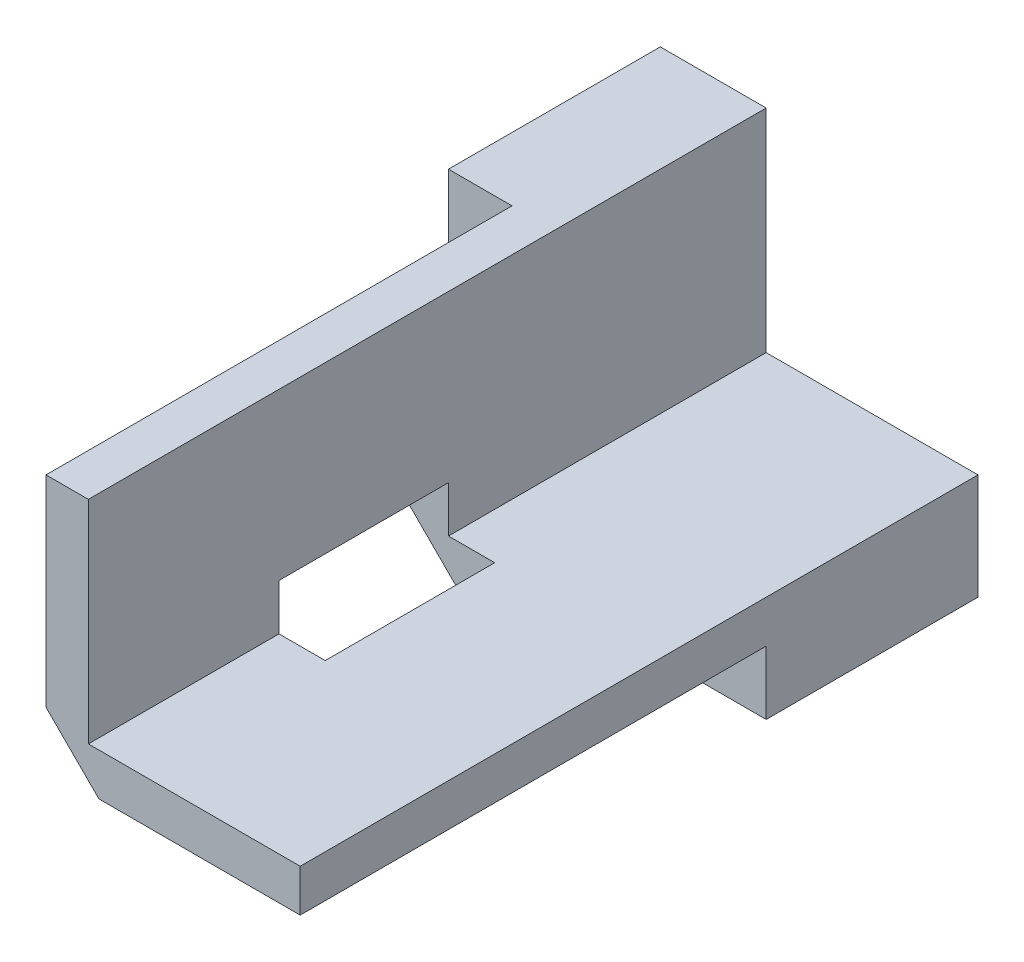
ISO-10303-21;
HEADER;
FILE_DESCRIPTION(('STEP AP214'),'2;1');
FILE_NAME('part.step','',(''),(''),'','','');
FILE_SCHEMA(('AUTOMOTIVE_DESIGN { 1 0 10303 214 1 1 1 1 }'));
ENDSEC;
DATA;
#1=APPLICATION_CONTEXT('core data for automotive mechanical design processes');
#2=APPLICATION_PROTOCOL_DEFINITION('international standard','automotive_design',2000,#1);
#3=PRODUCT_CONTEXT('',#1,'mechanical');
#4=PRODUCT('Part','Part','',(#3));
#5=PRODUCT_RELATED_PRODUCT_CATEGORY('part','',(#4));
#6=PRODUCT_DEFINITION_FORMATION('','',#4);
#7=PRODUCT_DEFINITION_CONTEXT('part definition',#1,'design');
#8=PRODUCT_DEFINITION('design','',#6,#7);
#9=PRODUCT_DEFINITION_SHAPE('','',#8);
#10=(LENGTH_UNIT() NAMED_UNIT(*) SI_UNIT(.MILLI.,.METRE.));
#11=(NAMED_UNIT(*) PLANE_ANGLE_UNIT() SI_UNIT($,.RADIAN.));
#12=(NAMED_UNIT(*) SI_UNIT($,.STERADIAN.) SOLID_ANGLE_UNIT());
#13=UNCERTAINTY_MEASURE_WITH_UNIT(LENGTH_MEASURE(1.E-05),#10,'distance_accuracy_value','');
#14=(GEOMETRIC_REPRESENTATION_CONTEXT(3) GLOBAL_UNCERTAINTY_ASSIGNED_CONTEXT((#13)) GLOBAL_UNIT_ASSIGNED_CONTEXT((#10,
#11,#12)) REPRESENTATION_CONTEXT('',''));
#15=CARTESIAN_POINT('',(0.,0.,0.));
#16=DIRECTION('',(0.,0.,1.));
#17=DIRECTION('',(1.,0.,0.));
#18=AXIS2_PLACEMENT_3D('',#15,#16,#17);
#19=CARTESIAN_POINT('',(-5.,10.,32.));
#20=DIRECTION('',(0.,-1.,0.));
#21=DIRECTION('',(0.,0.,-1.));
#22=AXIS2_PLACEMENT_3D('',#19,#20,#21);
#23=PLANE('',#22);
#24=DIRECTION('',(0.,0.,1.));
#25=VECTOR('',#24,1.);
#26=CARTESIAN_POINT('',(-2.,10.,-21.2132034355964));
#27=LINE('',#26,#25);
#28=CARTESIAN_POINT('',(-2.,10.,10.));
#29=VERTEX_POINT('',#28);
#30=CARTESIAN_POINT('',(-2.,10.,32.));
#31=VERTEX_POINT('',#30);
#32=EDGE_CURVE('E216',#29,#31,#27,.T.);
#33=ORIENTED_EDGE('',*,*,#32,.T.);
#34=DIRECTION('',(-1.,0.,0.));
#35=VECTOR('',#34,1.);
#36=CARTESIAN_POINT('',(-5.,10.,32.));
#37=LINE('',#36,#35);
#38=CARTESIAN_POINT('',(0.,10.,32.));
#39=VERTEX_POINT('',#38);
#40=EDGE_CURVE('E232',#39,#31,#37,.T.);
#41=ORIENTED_EDGE('',*,*,#40,.F.);
#42=DIRECTION('',(0.,0.,-1.));
#43=VECTOR('',#42,1.);
#44=CARTESIAN_POINT('',(0.,10.,32.));
#45=LINE('',#44,#43);
#46=CARTESIAN_POINT('',(0.,10.,0.));
#47=VERTEX_POINT('',#46);
#48=EDGE_CURVE('E242',#39,#47,#45,.T.);
#49=ORIENTED_EDGE('',*,*,#48,.T.);
#50=DIRECTION('',(-1.,0.,0.));
#51=VECTOR('',#50,1.);
#52=CARTESIAN_POINT('',(-5.,10.,0.));
#53=LINE('',#52,#51);
#54=CARTESIAN_POINT('',(-5.,10.,0.));
#55=VERTEX_POINT('',#54);
#56=EDGE_CURVE('E219',#47,#55,#53,.T.);
#57=ORIENTED_EDGE('',*,*,#56,.T.);
#58=DIRECTION('',(0.,0.,-1.));
#59=VECTOR('',#58,1.);
#60=CARTESIAN_POINT('',(-5.,10.,32.));
#61=LINE('',#60,#59);
#62=CARTESIAN_POINT('',(-5.,10.,10.));
#63=VERTEX_POINT('',#62);
#64=EDGE_CURVE('E268',#63,#55,#61,.T.);
#65=ORIENTED_EDGE('',*,*,#64,.F.);
#66=DIRECTION('',(-1.,0.,0.));
#67=VECTOR('',#66,1.);
#68=CARTESIAN_POINT('',(2.5,10.,10.));
#69=LINE('',#68,#67);
#70=EDGE_CURVE('E231',#29,#63,#69,.T.);
#71=ORIENTED_EDGE('',*,*,#70,.F.);
#72=EDGE_LOOP('',(#33,#41,#49,#57,#65,#71));
#73=FACE_BOUND('',#72,.T.);
#74=ADVANCED_FACE('F33',(#73),#23,.F.);
#75=CARTESIAN_POINT('',(10.,0.,32.));
#76=DIRECTION('',(-1.,0.,0.));
#77=DIRECTION('',(0.,0.,1.));
#78=AXIS2_PLACEMENT_3D('',#75,#76,#77);
#79=PLANE('',#78);
#80=DIRECTION('',(0.,0.,1.));
#81=VECTOR('',#80,1.);
#82=CARTESIAN_POINT('',(10.,-2.,-21.2132034355964));
#83=LINE('',#82,#81);
#84=CARTESIAN_POINT('',(10.,-2.,10.));
#85=VERTEX_POINT('',#84);
#86=CARTESIAN_POINT('',(10.,-2.,32.));
#87=VERTEX_POINT('',#86);
#88=EDGE_CURVE('E225',#85,#87,#83,.T.);
#89=ORIENTED_EDGE('',*,*,#88,.F.);
#90=DIRECTION('',(0.,1.,0.));
#91=VECTOR('',#90,1.);
#92=CARTESIAN_POINT('',(10.,-14.1414213562373,10.));
#93=LINE('',#92,#91);
#94=CARTESIAN_POINT('',(10.,-5.,10.));
#95=VERTEX_POINT('',#94);
#96=EDGE_CURVE('E229',#95,#85,#93,.T.);
#97=ORIENTED_EDGE('',*,*,#96,.F.);
#98=DIRECTION('',(0.,0.,-1.));
#99=VECTOR('',#98,1.);
#100=CARTESIAN_POINT('',(10.,-5.,32.));
#101=LINE('',#100,#99);
#102=CARTESIAN_POINT('',(10.,-5.,0.));
#103=VERTEX_POINT('',#102);
#104=EDGE_CURVE('E266',#95,#103,#101,.T.);
#105=ORIENTED_EDGE('',*,*,#104,.T.);
#106=DIRECTION('',(0.,1.,0.));
#107=VECTOR('',#106,1.);
#108=CARTESIAN_POINT('',(10.,0.,0.));
#109=LINE('',#108,#107);
#110=CARTESIAN_POINT('',(10.,0.,0.));
#111=VERTEX_POINT('',#110);
#112=EDGE_CURVE('E251',#103,#111,#109,.T.);
#113=ORIENTED_EDGE('',*,*,#112,.T.);
#114=DIRECTION('',(0.,0.,-1.));
#115=VECTOR('',#114,1.);
#116=CARTESIAN_POINT('',(10.,0.,32.));
#117=LINE('',#116,#115);
#118=CARTESIAN_POINT('',(10.,0.,32.));
#119=VERTEX_POINT('',#118);
#120=EDGE_CURVE('E263',#119,#111,#117,.T.);
#121=ORIENTED_EDGE('',*,*,#120,.F.);
#122=DIRECTION('',(0.,1.,0.));
#123=VECTOR('',#122,1.);
#124=CARTESIAN_POINT('',(10.,0.,32.));
#125=LINE('',#124,#123);
#126=EDGE_CURVE('E235',#87,#119,#125,.T.);
#127=ORIENTED_EDGE('',*,*,#126,.F.);
#128=EDGE_LOOP('',(#89,#97,#105,#113,#121,#127));
#129=FACE_BOUND('',#128,.T.);
#130=ADVANCED_FACE('F314',(#129),#79,.F.);
#131=CARTESIAN_POINT('',(0.,10.,32.));
#132=DIRECTION('',(0.,0.,-1.));
#133=DIRECTION('',(-1.,0.,0.));
#134=AXIS2_PLACEMENT_3D('',#131,#132,#133);
#135=PLANE('',#134);
#136=DIRECTION('',(0.,-1.,0.));
#137=VECTOR('',#136,1.);
#138=CARTESIAN_POINT('',(-2.,-14.1414213562373,32.));
#139=LINE('',#138,#137);
#140=CARTESIAN_POINT('',(-2.,0.500000000000006,32.));
#141=VERTEX_POINT('',#140);
#142=EDGE_CURVE('E217',#31,#141,#139,.T.);
#143=ORIENTED_EDGE('',*,*,#142,.T.);
#144=DIRECTION('',(-0.707106781186549,0.707106781186546,0.));
#145=VECTOR('',#144,1.);
#146=CARTESIAN_POINT('',(-2.,0.500000000000006,32.));
#147=LINE('',#146,#145);
#148=CARTESIAN_POINT('',(0.500000000000017,-2.,32.));
#149=VERTEX_POINT('',#148);
#150=EDGE_CURVE('E193',#141,#149,#147,.F.);
#151=ORIENTED_EDGE('',*,*,#150,.T.);
#152=DIRECTION('',(1.,0.,0.));
#153=VECTOR('',#152,1.);
#154=CARTESIAN_POINT('',(2.5,-2.,32.));
#155=LINE('',#154,#153);
#156=EDGE_CURVE('E294',#149,#87,#155,.T.);
#157=ORIENTED_EDGE('',*,*,#156,.T.);
#158=ORIENTED_EDGE('',*,*,#126,.T.);
#159=DIRECTION('',(-1.,0.,0.));
#160=VECTOR('',#159,1.);
#161=CARTESIAN_POINT('',(0.,0.,32.));
#162=LINE('',#161,#160);
#163=CARTESIAN_POINT('',(0.,0.,32.));
#164=VERTEX_POINT('',#163);
#165=EDGE_CURVE('E238',#119,#164,#162,.T.);
#166=ORIENTED_EDGE('',*,*,#165,.T.);
#167=DIRECTION('',(0.,1.,0.));
#168=VECTOR('',#167,1.);
#169=CARTESIAN_POINT('',(0.,10.,32.));
#170=LINE('',#169,#168);
#171=EDGE_CURVE('E240',#164,#39,#170,.T.);
#172=ORIENTED_EDGE('',*,*,#171,.T.);
#173=ORIENTED_EDGE('',*,*,#40,.T.);
#174=EDGE_LOOP('',(#143,#151,#157,#158,#166,#172,#173));
#175=FACE_BOUND('',#174,.T.);
#176=ADVANCED_FACE('F325',(#175),#135,.F.);
#177=CARTESIAN_POINT('',(-5.,10.,32.));
#178=DIRECTION('',(1.,0.,0.));
#179=DIRECTION('',(0.,1.,0.));
#180=AXIS2_PLACEMENT_3D('',#177,#178,#179);
#181=PLANE('',#180);
#182=DIRECTION('',(0.,0.,1.));
#183=VECTOR('',#182,1.);
#184=CARTESIAN_POINT('',(-5.,-2.99999999999999,32.));
#185=LINE('',#184,#183);
#186=CARTESIAN_POINT('',(-5.,-2.99999999999999,0.));
#187=VERTEX_POINT('',#186);
#188=CARTESIAN_POINT('',(-5.,-2.99999999999999,10.));
#189=VERTEX_POINT('',#188);
#190=EDGE_CURVE('E170',#187,#189,#185,.T.);
#191=ORIENTED_EDGE('',*,*,#190,.T.);
#192=DIRECTION('',(0.,-1.,0.));
#193=VECTOR('',#192,1.);
#194=CARTESIAN_POINT('',(-5.,-14.1414213562373,10.));
#195=LINE('',#194,#193);
#196=EDGE_CURVE('E279',#63,#189,#195,.T.);
#197=ORIENTED_EDGE('',*,*,#196,.F.);
#198=ORIENTED_EDGE('',*,*,#64,.T.);
#199=DIRECTION('',(0.,-1.,0.));
#200=VECTOR('',#199,1.);
#201=CARTESIAN_POINT('',(-5.,10.,0.));
#202=LINE('',#201,#200);
#203=EDGE_CURVE('E245',#55,#187,#202,.T.);
#204=ORIENTED_EDGE('',*,*,#203,.T.);
#205=EDGE_LOOP('',(#191,#197,#198,#204));
#206=FACE_BOUND('',#205,.T.);
#207=ADVANCED_FACE('F278',(#206),#181,.F.);
#208=CARTESIAN_POINT('',(-5.,-5.,32.));
#209=DIRECTION('',(0.,1.,0.));
#210=DIRECTION('',(0.,0.,1.));
#211=AXIS2_PLACEMENT_3D('',#208,#209,#210);
#212=PLANE('',#211);
#213=ORIENTED_EDGE('',*,*,#104,.F.);
#214=DIRECTION('',(1.,0.,0.));
#215=VECTOR('',#214,1.);
#216=CARTESIAN_POINT('',(2.5,-5.,10.));
#217=LINE('',#216,#215);
#218=CARTESIAN_POINT('',(-3.,-5.,10.));
#219=VERTEX_POINT('',#218);
#220=EDGE_CURVE('E228',#219,#95,#217,.T.);
#221=ORIENTED_EDGE('',*,*,#220,.F.);
#222=DIRECTION('',(0.,0.,-1.));
#223=VECTOR('',#222,1.);
#224=CARTESIAN_POINT('',(-3.,-5.,32.));
#225=LINE('',#224,#223);
#226=CARTESIAN_POINT('',(-3.,-5.,0.));
#227=VERTEX_POINT('',#226);
#228=EDGE_CURVE('E270',#219,#227,#225,.T.);
#229=ORIENTED_EDGE('',*,*,#228,.T.);
#230=DIRECTION('',(1.,0.,0.));
#231=VECTOR('',#230,1.);
#232=CARTESIAN_POINT('',(-5.,-5.,0.));
#233=LINE('',#232,#231);
#234=EDGE_CURVE('E248',#227,#103,#233,.T.);
#235=ORIENTED_EDGE('',*,*,#234,.T.);
#236=EDGE_LOOP('',(#213,#221,#229,#235));
#237=FACE_BOUND('',#236,.T.);
#238=ADVANCED_FACE('F312',(#237),#212,.F.);
#239=CARTESIAN_POINT('',(0.,0.,32.));
#240=DIRECTION('',(0.,-1.,0.));
#241=DIRECTION('',(1.,0.,0.));
#242=AXIS2_PLACEMENT_3D('',#239,#240,#241);
#243=PLANE('',#242);
#244=DIRECTION('',(0.,0.,-1.));
#245=VECTOR('',#244,1.);
#246=CARTESIAN_POINT('',(0.,0.,32.));
#247=LINE('',#246,#245);
#248=CARTESIAN_POINT('',(0.,0.,15.));
#249=VERTEX_POINT('',#248);
#250=CARTESIAN_POINT('',(0.,0.,0.));
#251=VERTEX_POINT('',#250);
#252=EDGE_CURVE('E259',#249,#251,#247,.T.);
#253=ORIENTED_EDGE('',*,*,#252,.F.);
#254=DIRECTION('',(1.,0.,0.));
#255=VECTOR('',#254,1.);
#256=CARTESIAN_POINT('',(0.,0.,15.));
#257=LINE('',#256,#255);
#258=CARTESIAN_POINT('',(2.18233764908629,0.,15.));
#259=VERTEX_POINT('',#258);
#260=EDGE_CURVE('E297',#249,#259,#257,.T.);
#261=ORIENTED_EDGE('',*,*,#260,.T.);
#262=DIRECTION('',(0.,0.,-1.));
#263=VECTOR('',#262,1.);
#264=CARTESIAN_POINT('',(2.18233764908629,0.,32.));
#265=LINE('',#264,#263);
#266=CARTESIAN_POINT('',(2.18233764908629,0.,23.));
#267=VERTEX_POINT('',#266);
#268=EDGE_CURVE('E342',#267,#259,#265,.T.);
#269=ORIENTED_EDGE('',*,*,#268,.F.);
#270=DIRECTION('',(-1.,0.,0.));
#271=VECTOR('',#270,1.);
#272=CARTESIAN_POINT('',(0.,0.,23.));
#273=LINE('',#272,#271);
#274=CARTESIAN_POINT('',(0.,0.,23.));
#275=VERTEX_POINT('',#274);
#276=EDGE_CURVE('E205',#267,#275,#273,.T.);
#277=ORIENTED_EDGE('',*,*,#276,.T.);
#278=EDGE_CURVE('E260',#164,#275,#247,.T.);
#279=ORIENTED_EDGE('',*,*,#278,.F.);
#280=ORIENTED_EDGE('',*,*,#165,.F.);
#281=ORIENTED_EDGE('',*,*,#120,.T.);
#282=DIRECTION('',(-1.,0.,0.));
#283=VECTOR('',#282,1.);
#284=CARTESIAN_POINT('',(0.,0.,0.));
#285=LINE('',#284,#283);
#286=EDGE_CURVE('E253',#111,#251,#285,.T.);
#287=ORIENTED_EDGE('',*,*,#286,.T.);
#288=EDGE_LOOP('',(#253,#261,#269,#277,#279,#280,#281,#287));
#289=FACE_BOUND('',#288,.T.);
#290=ADVANCED_FACE('F332',(#289),#243,.F.);
#291=CARTESIAN_POINT('',(0.,10.,32.));
#292=DIRECTION('',(-1.,0.,0.));
#293=DIRECTION('',(0.,-1.,0.));
#294=AXIS2_PLACEMENT_3D('',#291,#292,#293);
#295=PLANE('',#294);
#296=DIRECTION('',(0.,0.,1.));
#297=VECTOR('',#296,1.);
#298=CARTESIAN_POINT('',(0.,2.18233764908629,32.));
#299=LINE('',#298,#297);
#300=CARTESIAN_POINT('',(0.,2.18233764908629,15.));
#301=VERTEX_POINT('',#300);
#302=CARTESIAN_POINT('',(0.,2.18233764908629,23.));
#303=VERTEX_POINT('',#302);
#304=EDGE_CURVE('E339',#301,#303,#299,.T.);
#305=ORIENTED_EDGE('',*,*,#304,.F.);
#306=DIRECTION('',(0.,-1.,0.));
#307=VECTOR('',#306,1.);
#308=CARTESIAN_POINT('',(0.,10.,15.));
#309=LINE('',#308,#307);
#310=EDGE_CURVE('E177',#301,#249,#309,.T.);
#311=ORIENTED_EDGE('',*,*,#310,.T.);
#312=ORIENTED_EDGE('',*,*,#252,.T.);
#313=DIRECTION('',(0.,1.,0.));
#314=VECTOR('',#313,1.);
#315=CARTESIAN_POINT('',(0.,10.,0.));
#316=LINE('',#315,#314);
#317=EDGE_CURVE('E236',#251,#47,#316,.T.);
#318=ORIENTED_EDGE('',*,*,#317,.T.);
#319=ORIENTED_EDGE('',*,*,#48,.F.);
#320=ORIENTED_EDGE('',*,*,#171,.F.);
#321=ORIENTED_EDGE('',*,*,#278,.T.);
#322=DIRECTION('',(0.,1.,0.));
#323=VECTOR('',#322,1.);
#324=CARTESIAN_POINT('',(0.,10.,23.));
#325=LINE('',#324,#323);
#326=EDGE_CURVE('E338',#275,#303,#325,.T.);
#327=ORIENTED_EDGE('',*,*,#326,.T.);
#328=EDGE_LOOP('',(#305,#311,#312,#318,#319,#320,#321,#327));
#329=FACE_BOUND('',#328,.T.);
#330=ADVANCED_FACE('F329',(#329),#295,.F.);
#331=CARTESIAN_POINT('',(0.,10.,0.));
#332=DIRECTION('',(0.,0.,-1.));
#333=DIRECTION('',(-1.,0.,0.));
#334=AXIS2_PLACEMENT_3D('',#331,#332,#333);
#335=PLANE('',#334);
#336=CARTESIAN_POINT('',(-2.,-2.,0.));
#337=DIRECTION('',(0.,0.,-1.));
#338=DIRECTION('',(-1.,0.,0.));
#339=AXIS2_PLACEMENT_3D('',#336,#337,#338);
#340=CIRCLE('',#339,1.651);
#341=CARTESIAN_POINT('',(-3.651,-2.,0.));
#342=VERTEX_POINT('',#341);
#343=EDGE_CURVE('E357',#342,#342,#340,.T.);
#344=ORIENTED_EDGE('',*,*,#343,.F.);
#345=EDGE_LOOP('',(#344));
#346=FACE_BOUND('',#345,.T.);
#347=ORIENTED_EDGE('',*,*,#234,.F.);
#348=DIRECTION('',(0.707106781186546,-0.707106781186549,0.));
#349=VECTOR('',#348,1.);
#350=CARTESIAN_POINT('',(-9.00000000000001,1.00000000000004,0.));
#351=LINE('',#350,#349);
#352=EDGE_CURVE('E272',#227,#187,#351,.F.);
#353=ORIENTED_EDGE('',*,*,#352,.T.);
#354=ORIENTED_EDGE('',*,*,#203,.F.);
#355=ORIENTED_EDGE('',*,*,#56,.F.);
#356=ORIENTED_EDGE('',*,*,#317,.F.);
#357=ORIENTED_EDGE('',*,*,#286,.F.);
#358=ORIENTED_EDGE('',*,*,#112,.F.);
#359=EDGE_LOOP('',(#347,#353,#354,#355,#356,#357,#358));
#360=FACE_BOUND('',#359,.T.);
#361=ADVANCED_FACE('F306',(#346,#360),#335,.T.);
#362=CARTESIAN_POINT('',(-3.,-5.,32.));
#363=DIRECTION('',(0.707106781186549,0.707106781186546,0.));
#364=DIRECTION('',(-0.707106781186546,0.707106781186549,0.));
#365=AXIS2_PLACEMENT_3D('',#362,#363,#364);
#366=PLANE('',#365);
#367=DIRECTION('',(0.707106781186546,-0.707106781186549,0.));
#368=VECTOR('',#367,1.);
#369=CARTESIAN_POINT('',(4.32071067811864,-12.3207106781187,10.));
#370=LINE('',#369,#368);
#371=EDGE_CURVE('E288',#189,#219,#370,.T.);
#372=ORIENTED_EDGE('',*,*,#371,.F.);
#373=ORIENTED_EDGE('',*,*,#190,.F.);
#374=ORIENTED_EDGE('',*,*,#352,.F.);
#375=ORIENTED_EDGE('',*,*,#228,.F.);
#376=EDGE_LOOP('',(#372,#373,#374,#375));
#377=FACE_BOUND('',#376,.T.);
#378=ADVANCED_FACE('F285',(#377),#366,.F.);
#379=CARTESIAN_POINT('',(2.5,-2.,-21.2132034355964));
#380=DIRECTION('',(0.,-1.,0.));
#381=DIRECTION('',(0.,0.,-1.));
#382=AXIS2_PLACEMENT_3D('',#379,#380,#381);
#383=PLANE('',#382);
#384=ORIENTED_EDGE('',*,*,#156,.F.);
#385=DIRECTION('',(0.,0.,-1.));
#386=VECTOR('',#385,1.);
#387=CARTESIAN_POINT('',(0.500000000000017,-2.,-21.2132034355964));
#388=LINE('',#387,#386);
#389=CARTESIAN_POINT('',(0.500000000000016,-2.,23.));
#390=VERTEX_POINT('',#389);
#391=EDGE_CURVE('E48',#149,#390,#388,.T.);
#392=ORIENTED_EDGE('',*,*,#391,.T.);
#393=DIRECTION('',(-1.,0.,0.));
#394=VECTOR('',#393,1.);
#395=CARTESIAN_POINT('',(2.49999999999999,-2.,23.));
#396=LINE('',#395,#394);
#397=CARTESIAN_POINT('',(4.18233764908628,-2.,23.));
#398=VERTEX_POINT('',#397);
#399=EDGE_CURVE('E324',#398,#390,#396,.T.);
#400=ORIENTED_EDGE('',*,*,#399,.F.);
#401=DIRECTION('',(0.,0.,-1.));
#402=VECTOR('',#401,1.);
#403=CARTESIAN_POINT('',(4.18233764908628,-2.,-21.2132034355964));
#404=LINE('',#403,#402);
#405=CARTESIAN_POINT('',(4.18233764908628,-2.,15.));
#406=VERTEX_POINT('',#405);
#407=EDGE_CURVE('E204',#398,#406,#404,.T.);
#408=ORIENTED_EDGE('',*,*,#407,.T.);
#409=DIRECTION('',(1.,0.,0.));
#410=VECTOR('',#409,1.);
#411=CARTESIAN_POINT('',(2.5,-2.,15.));
#412=LINE('',#411,#410);
#413=CARTESIAN_POINT('',(0.500000000000017,-2.,15.));
#414=VERTEX_POINT('',#413);
#415=EDGE_CURVE('E199',#414,#406,#412,.T.);
#416=ORIENTED_EDGE('',*,*,#415,.F.);
#417=DIRECTION('',(0.,0.,-1.));
#418=VECTOR('',#417,1.);
#419=CARTESIAN_POINT('',(0.500000000000017,-2.,-21.2132034355964));
#420=LINE('',#419,#418);
#421=CARTESIAN_POINT('',(0.500000000000017,-2.,10.));
#422=VERTEX_POINT('',#421);
#423=EDGE_CURVE('E55',#414,#422,#420,.T.);
#424=ORIENTED_EDGE('',*,*,#423,.T.);
#425=DIRECTION('',(1.,0.,0.));
#426=VECTOR('',#425,1.);
#427=CARTESIAN_POINT('',(2.5,-2.,10.));
#428=LINE('',#427,#426);
#429=EDGE_CURVE('E214',#422,#85,#428,.T.);
#430=ORIENTED_EDGE('',*,*,#429,.T.);
#431=ORIENTED_EDGE('',*,*,#88,.T.);
#432=EDGE_LOOP('',(#384,#392,#400,#408,#416,#424,#430,#431));
#433=FACE_BOUND('',#432,.T.);
#434=ADVANCED_FACE('F203',(#433),#383,.T.);
#435=CARTESIAN_POINT('',(-2.,-14.1414213562373,-21.2132034355964));
#436=DIRECTION('',(-1.,0.,0.));
#437=DIRECTION('',(0.,-1.,0.));
#438=AXIS2_PLACEMENT_3D('',#435,#436,#437);
#439=PLANE('',#438);
#440=DIRECTION('',(0.,1.,0.));
#441=VECTOR('',#440,1.);
#442=CARTESIAN_POINT('',(-2.,-14.1414213562373,23.));
#443=LINE('',#442,#441);
#444=CARTESIAN_POINT('',(-2.,0.500000000000006,23.));
#445=VERTEX_POINT('',#444);
#446=CARTESIAN_POINT('',(-2.,4.1823376490863,23.));
#447=VERTEX_POINT('',#446);
#448=EDGE_CURVE('E169',#445,#447,#443,.T.);
#449=ORIENTED_EDGE('',*,*,#448,.F.);
#450=DIRECTION('',(0.,0.,1.));
#451=VECTOR('',#450,1.);
#452=CARTESIAN_POINT('',(-2.,0.500000000000006,-21.2132034355964));
#453=LINE('',#452,#451);
#454=EDGE_CURVE('E187',#445,#141,#453,.T.);
#455=ORIENTED_EDGE('',*,*,#454,.T.);
#456=ORIENTED_EDGE('',*,*,#142,.F.);
#457=ORIENTED_EDGE('',*,*,#32,.F.);
#458=DIRECTION('',(0.,-1.,0.));
#459=VECTOR('',#458,1.);
#460=CARTESIAN_POINT('',(-2.,-14.1414213562373,10.));
#461=LINE('',#460,#459);
#462=CARTESIAN_POINT('',(-2.,0.500000000000006,10.));
#463=VERTEX_POINT('',#462);
#464=EDGE_CURVE('E211',#29,#463,#461,.T.);
#465=ORIENTED_EDGE('',*,*,#464,.T.);
#466=DIRECTION('',(0.,0.,1.));
#467=VECTOR('',#466,1.);
#468=CARTESIAN_POINT('',(-2.,0.500000000000006,-21.2132034355964));
#469=LINE('',#468,#467);
#470=CARTESIAN_POINT('',(-2.,0.500000000000006,15.));
#471=VERTEX_POINT('',#470);
#472=EDGE_CURVE('E185',#463,#471,#469,.T.);
#473=ORIENTED_EDGE('',*,*,#472,.T.);
#474=DIRECTION('',(0.,-1.,0.));
#475=VECTOR('',#474,1.);
#476=CARTESIAN_POINT('',(-2.,-14.1414213562373,15.));
#477=LINE('',#476,#475);
#478=CARTESIAN_POINT('',(-2.,4.1823376490863,15.));
#479=VERTEX_POINT('',#478);
#480=EDGE_CURVE('E175',#479,#471,#477,.T.);
#481=ORIENTED_EDGE('',*,*,#480,.F.);
#482=DIRECTION('',(0.,0.,1.));
#483=VECTOR('',#482,1.);
#484=CARTESIAN_POINT('',(-2.,4.1823376490863,-21.2132034355964));
#485=LINE('',#484,#483);
#486=EDGE_CURVE('E159',#479,#447,#485,.T.);
#487=ORIENTED_EDGE('',*,*,#486,.T.);
#488=EDGE_LOOP('',(#449,#455,#456,#457,#465,#473,#481,#487));
#489=FACE_BOUND('',#488,.T.);
#490=ADVANCED_FACE('F182',(#489),#439,.T.);
#491=CARTESIAN_POINT('',(0.,10.,10.));
#492=DIRECTION('',(0.,0.,-1.));
#493=DIRECTION('',(-1.,0.,0.));
#494=AXIS2_PLACEMENT_3D('',#491,#492,#493);
#495=PLANE('',#494);
#496=CARTESIAN_POINT('',(-2.,-2.,10.));
#497=DIRECTION('',(0.,0.,-1.));
#498=DIRECTION('',(-1.,0.,0.));
#499=AXIS2_PLACEMENT_3D('',#496,#497,#498);
#500=CIRCLE('',#499,1.651);
#501=CARTESIAN_POINT('',(-3.651,-2.,10.));
#502=VERTEX_POINT('',#501);
#503=EDGE_CURVE('E360',#502,#502,#500,.T.);
#504=ORIENTED_EDGE('',*,*,#503,.T.);
#505=EDGE_LOOP('',(#504));
#506=FACE_BOUND('',#505,.T.);
#507=ORIENTED_EDGE('',*,*,#464,.F.);
#508=ORIENTED_EDGE('',*,*,#70,.T.);
#509=ORIENTED_EDGE('',*,*,#196,.T.);
#510=ORIENTED_EDGE('',*,*,#371,.T.);
#511=ORIENTED_EDGE('',*,*,#220,.T.);
#512=ORIENTED_EDGE('',*,*,#96,.T.);
#513=ORIENTED_EDGE('',*,*,#429,.F.);
#514=DIRECTION('',(0.707106781186549,-0.707106781186546,0.));
#515=VECTOR('',#514,1.);
#516=CARTESIAN_POINT('',(-5.74999999999999,4.24999999999998,10.));
#517=LINE('',#516,#515);
#518=EDGE_CURVE('E12',#422,#463,#517,.F.);
#519=ORIENTED_EDGE('',*,*,#518,.T.);
#520=EDGE_LOOP('',(#507,#508,#509,#510,#511,#512,#513,#519));
#521=FACE_BOUND('',#520,.T.);
#522=ADVANCED_FACE('F210',(#506,#521),#495,.F.);
#523=CARTESIAN_POINT('',(-8.8083261120685,10.9906637611548,15.));
#524=DIRECTION('',(0.,0.,-1.));
#525=DIRECTION('',(0.,1.,0.));
#526=AXIS2_PLACEMENT_3D('',#523,#524,#525);
#527=PLANE('',#526);
#528=ORIENTED_EDGE('',*,*,#480,.T.);
#529=DIRECTION('',(-0.707106781186549,0.707106781186546,0.));
#530=VECTOR('',#529,1.);
#531=CARTESIAN_POINT('',(-2.,0.500000000000009,15.));
#532=LINE('',#531,#530);
#533=EDGE_CURVE('E41',#471,#414,#532,.F.);
#534=ORIENTED_EDGE('',*,*,#533,.T.);
#535=ORIENTED_EDGE('',*,*,#415,.T.);
#536=DIRECTION('',(0.707106781186547,-0.707106781186549,0.));
#537=VECTOR('',#536,1.);
#538=CARTESIAN_POINT('',(-8.8083261120685,10.9906637611548,15.));
#539=LINE('',#538,#537);
#540=EDGE_CURVE('E179',#259,#406,#539,.T.);
#541=ORIENTED_EDGE('',*,*,#540,.F.);
#542=ORIENTED_EDGE('',*,*,#260,.F.);
#543=ORIENTED_EDGE('',*,*,#310,.F.);
#544=EDGE_CURVE('E162',#479,#301,#539,.T.);
#545=ORIENTED_EDGE('',*,*,#544,.F.);
#546=EDGE_LOOP('',(#528,#534,#535,#541,#542,#543,#545));
#547=FACE_BOUND('',#546,.T.);
#548=ADVANCED_FACE('F174',(#547),#527,.F.);
#549=CARTESIAN_POINT('',(-8.8083261120685,10.9906637611548,23.));
#550=DIRECTION('',(0.,0.,1.));
#551=DIRECTION('',(0.,-1.,0.));
#552=AXIS2_PLACEMENT_3D('',#549,#550,#551);
#553=PLANE('',#552);
#554=ORIENTED_EDGE('',*,*,#399,.T.);
#555=DIRECTION('',(0.707106781186549,-0.707106781186546,0.));
#556=VECTOR('',#555,1.);
#557=CARTESIAN_POINT('',(-2.00000000000001,0.500000000000013,23.));
#558=LINE('',#557,#556);
#559=EDGE_CURVE('E197',#390,#445,#558,.F.);
#560=ORIENTED_EDGE('',*,*,#559,.T.);
#561=ORIENTED_EDGE('',*,*,#448,.T.);
#562=DIRECTION('',(-0.707106781186547,0.707106781186548,0.));
#563=VECTOR('',#562,1.);
#564=CARTESIAN_POINT('',(-8.8083261120685,10.9906637611548,23.));
#565=LINE('',#564,#563);
#566=EDGE_CURVE('E165',#303,#447,#565,.T.);
#567=ORIENTED_EDGE('',*,*,#566,.F.);
#568=ORIENTED_EDGE('',*,*,#326,.F.);
#569=ORIENTED_EDGE('',*,*,#276,.F.);
#570=EDGE_CURVE('E349',#398,#267,#565,.T.);
#571=ORIENTED_EDGE('',*,*,#570,.F.);
#572=EDGE_LOOP('',(#554,#560,#561,#567,#568,#569,#571));
#573=FACE_BOUND('',#572,.T.);
#574=ADVANCED_FACE('F322',(#573),#553,.F.);
#575=CARTESIAN_POINT('',(10.9906637611548,-8.80832611206854,15.));
#576=DIRECTION('',(-0.707106781186549,-0.707106781186546,0.));
#577=DIRECTION('',(0.707106781186546,-0.707106781186549,0.));
#578=AXIS2_PLACEMENT_3D('',#575,#576,#577);
#579=PLANE('',#578);
#580=ORIENTED_EDGE('',*,*,#268,.T.);
#581=ORIENTED_EDGE('',*,*,#540,.T.);
#582=ORIENTED_EDGE('',*,*,#407,.F.);
#583=ORIENTED_EDGE('',*,*,#570,.T.);
#584=EDGE_LOOP('',(#580,#581,#582,#583));
#585=FACE_BOUND('',#584,.T.);
#586=ADVANCED_FACE('F405',(#585),#579,.T.);
#587=ORIENTED_EDGE('',*,*,#304,.T.);
#588=ORIENTED_EDGE('',*,*,#566,.T.);
#589=ORIENTED_EDGE('',*,*,#486,.F.);
#590=ORIENTED_EDGE('',*,*,#544,.T.);
#591=EDGE_LOOP('',(#587,#588,#589,#590));
#592=FACE_BOUND('',#591,.T.);
#593=ADVANCED_FACE('F161',(#592),#579,.T.);
#594=CARTESIAN_POINT('',(-2.,0.500000000000006,-21.2132034355964));
#595=DIRECTION('',(0.707106781186546,0.707106781186549,0.));
#596=DIRECTION('',(-0.707106781186549,0.707106781186546,0.));
#597=AXIS2_PLACEMENT_3D('',#594,#595,#596);
#598=PLANE('',#597);
#599=ORIENTED_EDGE('',*,*,#559,.F.);
#600=ORIENTED_EDGE('',*,*,#391,.F.);
#601=ORIENTED_EDGE('',*,*,#150,.F.);
#602=ORIENTED_EDGE('',*,*,#454,.F.);
#603=EDGE_LOOP('',(#599,#600,#601,#602));
#604=FACE_BOUND('',#603,.T.);
#605=ADVANCED_FACE('F319',(#604),#598,.F.);
#606=CARTESIAN_POINT('',(-2.,0.500000000000006,-21.2132034355964));
#607=DIRECTION('',(0.707106781186546,0.707106781186549,0.));
#608=DIRECTION('',(-0.707106781186549,0.707106781186546,0.));
#609=AXIS2_PLACEMENT_3D('',#606,#607,#608);
#610=PLANE('',#609);
#611=ORIENTED_EDGE('',*,*,#518,.F.);
#612=ORIENTED_EDGE('',*,*,#423,.F.);
#613=ORIENTED_EDGE('',*,*,#533,.F.);
#614=ORIENTED_EDGE('',*,*,#472,.F.);
#615=EDGE_LOOP('',(#611,#612,#613,#614));
#616=FACE_BOUND('',#615,.T.);
#617=ADVANCED_FACE('F35',(#616),#610,.F.);
#618=CARTESIAN_POINT('',(-2.,-2.,9.83993255676526));
#619=DIRECTION('',(0.,0.,1.));
#620=DIRECTION('',(1.,0.,0.));
#621=AXIS2_PLACEMENT_3D('',#618,#619,#620);
#622=CONICAL_SURFACE('',#621,1.4224,0.959931088596886);
#623=ORIENTED_EDGE('',*,*,#503,.F.);
#624=EDGE_LOOP('',(#623));
#625=FACE_BOUND('',#624,.T.);
#626=CARTESIAN_POINT('',(-2.,-2.,9.83993255676526));
#627=DIRECTION('',(0.,0.,-1.));
#628=DIRECTION('',(-1.,0.,0.));
#629=AXIS2_PLACEMENT_3D('',#626,#627,#628);
#630=CIRCLE('',#629,1.4224);
#631=CARTESIAN_POINT('',(-3.4224,-2.,9.83993255676526));
#632=VERTEX_POINT('',#631);
#633=EDGE_CURVE('E351',#632,#632,#630,.T.);
#634=ORIENTED_EDGE('',*,*,#633,.T.);
#635=EDGE_LOOP('',(#634));
#636=FACE_BOUND('',#635,.T.);
#637=ADVANCED_FACE('F365',(#625,#636),#622,.F.);
#638=CARTESIAN_POINT('',(-2.,-2.,0.));
#639=DIRECTION('',(0.,0.,-1.));
#640=DIRECTION('',(-1.,0.,0.));
#641=AXIS2_PLACEMENT_3D('',#638,#639,#640);
#642=CYLINDRICAL_SURFACE('',#641,1.4224);
#643=ORIENTED_EDGE('',*,*,#633,.F.);
#644=EDGE_LOOP('',(#643));
#645=FACE_BOUND('',#644,.T.);
#646=CARTESIAN_POINT('',(-2.,-2.,0.16006744323474));
#647=DIRECTION('',(0.,0.,-1.));
#648=DIRECTION('',(-1.,0.,0.));
#649=AXIS2_PLACEMENT_3D('',#646,#647,#648);
#650=CIRCLE('',#649,1.4224);
#651=CARTESIAN_POINT('',(-3.4224,-2.,0.16006744323474));
#652=VERTEX_POINT('',#651);
#653=EDGE_CURVE('E354',#652,#652,#650,.T.);
#654=ORIENTED_EDGE('',*,*,#653,.T.);
#655=EDGE_LOOP('',(#654));
#656=FACE_BOUND('',#655,.T.);
#657=ADVANCED_FACE('F368',(#645,#656),#642,.F.);
#658=CARTESIAN_POINT('',(-2.,-2.,0.));
#659=DIRECTION('',(0.,0.,-1.));
#660=DIRECTION('',(-1.,0.,0.));
#661=AXIS2_PLACEMENT_3D('',#658,#659,#660);
#662=CONICAL_SURFACE('',#661,1.651,0.959931088596876);
#663=ORIENTED_EDGE('',*,*,#653,.F.);
#664=EDGE_LOOP('',(#663));
#665=FACE_BOUND('',#664,.T.);
#666=ORIENTED_EDGE('',*,*,#343,.T.);
#667=EDGE_LOOP('',(#666));
#668=FACE_BOUND('',#667,.T.);
#669=ADVANCED_FACE('F374',(#665,#668),#662,.F.);
#670=CLOSED_SHELL('',(#74,#130,#176,#207,#238,#290,#330,#361,#378,#434,#490,#522,#548,#574,#586,
#593,#605,#617,#637,#657,#669));
#671=MANIFOLD_SOLID_BREP('B2',#670);
#672=ADVANCED_BREP_SHAPE_REPRESENTATION('',(#18,#671),#14);
#673=SHAPE_DEFINITION_REPRESENTATION(#9,#672);
ENDSEC;
END-ISO-10303-21;
